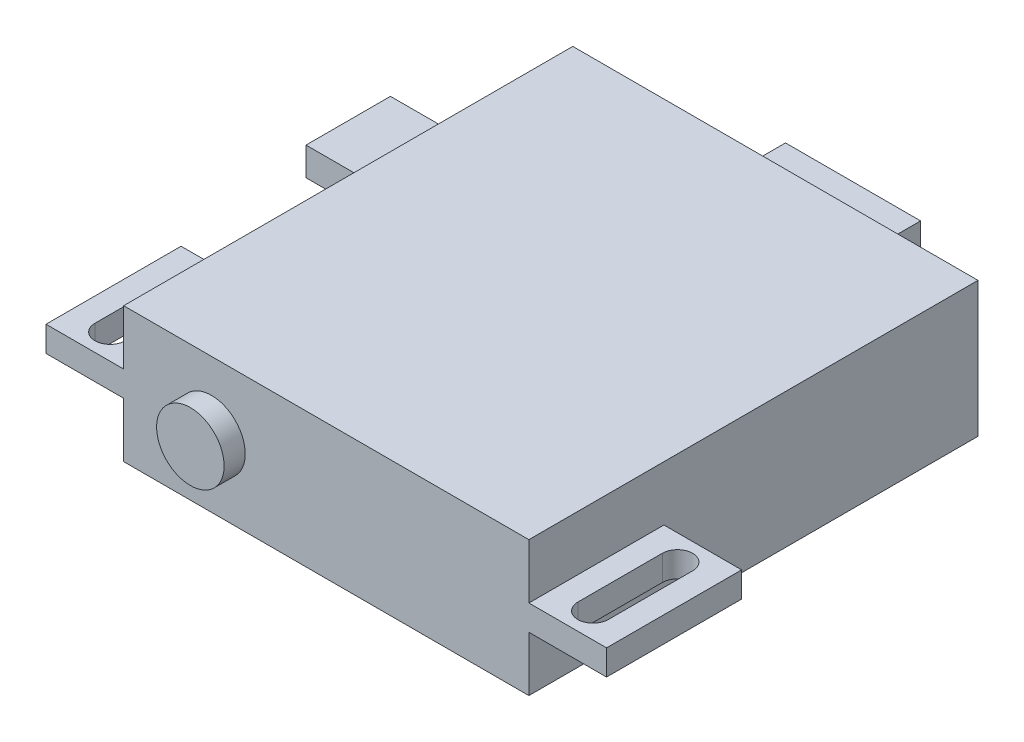
ISO-10303-21;
HEADER;
FILE_DESCRIPTION(('STEP AP214'),'2;1');
FILE_NAME('part.step','',(''),(''),'','','');
FILE_SCHEMA(('AUTOMOTIVE_DESIGN { 1 0 10303 214 1 1 1 1 }'));
ENDSEC;
DATA;
#1=APPLICATION_CONTEXT('core data for automotive mechanical design processes');
#2=APPLICATION_PROTOCOL_DEFINITION('international standard','automotive_design',2000,#1);
#3=PRODUCT_CONTEXT('',#1,'mechanical');
#4=PRODUCT('Part','Part','',(#3));
#5=PRODUCT_RELATED_PRODUCT_CATEGORY('part','',(#4));
#6=PRODUCT_DEFINITION_FORMATION('','',#4);
#7=PRODUCT_DEFINITION_CONTEXT('part definition',#1,'design');
#8=PRODUCT_DEFINITION('design','',#6,#7);
#9=PRODUCT_DEFINITION_SHAPE('','',#8);
#10=(LENGTH_UNIT() NAMED_UNIT(*) SI_UNIT(.MILLI.,.METRE.));
#11=(NAMED_UNIT(*) PLANE_ANGLE_UNIT() SI_UNIT($,.RADIAN.));
#12=(NAMED_UNIT(*) SI_UNIT($,.STERADIAN.) SOLID_ANGLE_UNIT());
#13=UNCERTAINTY_MEASURE_WITH_UNIT(LENGTH_MEASURE(1.E-05),#10,'distance_accuracy_value','');
#14=(GEOMETRIC_REPRESENTATION_CONTEXT(3) GLOBAL_UNCERTAINTY_ASSIGNED_CONTEXT((#13)) GLOBAL_UNIT_ASSIGNED_CONTEXT((#10,
#11,#12)) REPRESENTATION_CONTEXT('',''));
#15=CARTESIAN_POINT('',(0.,0.,0.));
#16=DIRECTION('',(0.,0.,1.));
#17=DIRECTION('',(1.,0.,0.));
#18=AXIS2_PLACEMENT_3D('',#15,#16,#17);
#19=CARTESIAN_POINT('',(-15.24,5.08,-16.891));
#20=DIRECTION('',(1.,0.,0.));
#21=DIRECTION('',(0.,0.,-1.));
#22=AXIS2_PLACEMENT_3D('',#19,#20,#21);
#23=PLANE('',#22);
#24=DIRECTION('',(0.,0.,1.));
#25=VECTOR('',#24,1.);
#26=CARTESIAN_POINT('',(-15.24,-0.9525,6.731));
#27=LINE('',#26,#25);
#28=CARTESIAN_POINT('',(-15.24,-0.9525,6.731));
#29=VERTEX_POINT('',#28);
#30=CARTESIAN_POINT('',(-15.24,-0.9525,16.891));
#31=VERTEX_POINT('',#30);
#32=EDGE_CURVE('E367',#29,#31,#27,.T.);
#33=ORIENTED_EDGE('',*,*,#32,.F.);
#34=DIRECTION('',(0.,-1.,0.));
#35=VECTOR('',#34,1.);
#36=CARTESIAN_POINT('',(-15.24,0.9525,6.731));
#37=LINE('',#36,#35);
#38=CARTESIAN_POINT('',(-15.24,0.9525,6.731));
#39=VERTEX_POINT('',#38);
#40=EDGE_CURVE('E394',#39,#29,#37,.T.);
#41=ORIENTED_EDGE('',*,*,#40,.F.);
#42=DIRECTION('',(0.,0.,1.));
#43=VECTOR('',#42,1.);
#44=CARTESIAN_POINT('',(-15.24,0.9525,6.731));
#45=LINE('',#44,#43);
#46=CARTESIAN_POINT('',(-15.24,0.9525,16.891));
#47=VERTEX_POINT('',#46);
#48=EDGE_CURVE('E368',#39,#47,#45,.T.);
#49=ORIENTED_EDGE('',*,*,#48,.T.);
#50=DIRECTION('',(0.,-1.,0.));
#51=VECTOR('',#50,1.);
#52=CARTESIAN_POINT('',(-15.24,5.08,16.891));
#53=LINE('',#52,#51);
#54=CARTESIAN_POINT('',(-15.24,5.08,16.891));
#55=VERTEX_POINT('',#54);
#56=EDGE_CURVE('E483',#55,#47,#53,.T.);
#57=ORIENTED_EDGE('',*,*,#56,.F.);
#58=DIRECTION('',(0.,0.,1.));
#59=VECTOR('',#58,1.);
#60=CARTESIAN_POINT('',(-15.24,5.08,-16.891));
#61=LINE('',#60,#59);
#62=CARTESIAN_POINT('',(-15.24,5.08,-16.891));
#63=VERTEX_POINT('',#62);
#64=EDGE_CURVE('E465',#63,#55,#61,.T.);
#65=ORIENTED_EDGE('',*,*,#64,.F.);
#66=DIRECTION('',(0.,-1.,0.));
#67=VECTOR('',#66,1.);
#68=CARTESIAN_POINT('',(-15.24,5.08,-16.891));
#69=LINE('',#68,#67);
#70=CARTESIAN_POINT('',(-15.24,-5.08,-16.891));
#71=VERTEX_POINT('',#70);
#72=EDGE_CURVE('E486',#63,#71,#69,.T.);
#73=ORIENTED_EDGE('',*,*,#72,.T.);
#74=DIRECTION('',(0.,0.,1.));
#75=VECTOR('',#74,1.);
#76=CARTESIAN_POINT('',(-15.24,-5.08,-16.891));
#77=LINE('',#76,#75);
#78=CARTESIAN_POINT('',(-15.24,-5.08,16.891));
#79=VERTEX_POINT('',#78);
#80=EDGE_CURVE('E474',#71,#79,#77,.T.);
#81=ORIENTED_EDGE('',*,*,#80,.T.);
#82=EDGE_CURVE('E482',#31,#79,#53,.T.);
#83=ORIENTED_EDGE('',*,*,#82,.F.);
#84=EDGE_LOOP('',(#33,#41,#49,#57,#65,#73,#81,#83));
#85=FACE_BOUND('',#84,.T.);
#86=DIRECTION('',(0.,1.,0.));
#87=VECTOR('',#86,1.);
#88=CARTESIAN_POINT('',(-15.24,1.06561722615101,-4.445));
#89=LINE('',#88,#87);
#90=CARTESIAN_POINT('',(-15.24,-1.06561722615101,-4.445));
#91=VERTEX_POINT('',#90);
#92=CARTESIAN_POINT('',(-15.24,1.06561722615101,-4.445));
#93=VERTEX_POINT('',#92);
#94=EDGE_CURVE('E267',#91,#93,#89,.T.);
#95=ORIENTED_EDGE('',*,*,#94,.F.);
#96=DIRECTION('',(0.,0.,1.));
#97=VECTOR('',#96,1.);
#98=CARTESIAN_POINT('',(-15.24,-1.06561722615101,-10.795));
#99=LINE('',#98,#97);
#100=CARTESIAN_POINT('',(-15.24,-1.06561722615101,-10.795));
#101=VERTEX_POINT('',#100);
#102=EDGE_CURVE('E264',#101,#91,#99,.T.);
#103=ORIENTED_EDGE('',*,*,#102,.F.);
#104=DIRECTION('',(0.,-1.,0.));
#105=VECTOR('',#104,1.);
#106=CARTESIAN_POINT('',(-15.24,1.06561722615101,-10.795));
#107=LINE('',#106,#105);
#108=CARTESIAN_POINT('',(-15.24,1.06561722615101,-10.795));
#109=VERTEX_POINT('',#108);
#110=EDGE_CURVE('E58',#109,#101,#107,.T.);
#111=ORIENTED_EDGE('',*,*,#110,.F.);
#112=DIRECTION('',(0.,0.,-1.));
#113=VECTOR('',#112,1.);
#114=CARTESIAN_POINT('',(-15.24,1.06561722615101,-10.795));
#115=LINE('',#114,#113);
#116=EDGE_CURVE('E53',#93,#109,#115,.T.);
#117=ORIENTED_EDGE('',*,*,#116,.F.);
#118=EDGE_LOOP('',(#95,#103,#111,#117));
#119=FACE_BOUND('',#118,.T.);
#120=ADVANCED_FACE('F38',(#85,#119),#23,.F.);
#121=CARTESIAN_POINT('',(15.24,5.08,-16.891));
#122=DIRECTION('',(-1.,0.,0.));
#123=DIRECTION('',(0.,0.,1.));
#124=AXIS2_PLACEMENT_3D('',#121,#122,#123);
#125=PLANE('',#124);
#126=DIRECTION('',(0.,-1.,0.));
#127=VECTOR('',#126,1.);
#128=CARTESIAN_POINT('',(15.24,0.9525,6.731));
#129=LINE('',#128,#127);
#130=CARTESIAN_POINT('',(15.24,0.9525,6.731));
#131=VERTEX_POINT('',#130);
#132=CARTESIAN_POINT('',(15.24,-0.9525,6.731));
#133=VERTEX_POINT('',#132);
#134=EDGE_CURVE('E438',#131,#133,#129,.T.);
#135=ORIENTED_EDGE('',*,*,#134,.T.);
#136=DIRECTION('',(0.,0.,1.));
#137=VECTOR('',#136,1.);
#138=CARTESIAN_POINT('',(15.24,-0.9525,6.731));
#139=LINE('',#138,#137);
#140=CARTESIAN_POINT('',(15.24,-0.9525,16.891));
#141=VERTEX_POINT('',#140);
#142=EDGE_CURVE('E427',#133,#141,#139,.T.);
#143=ORIENTED_EDGE('',*,*,#142,.T.);
#144=DIRECTION('',(0.,-1.,0.));
#145=VECTOR('',#144,1.);
#146=CARTESIAN_POINT('',(15.24,5.08,16.891));
#147=LINE('',#146,#145);
#148=CARTESIAN_POINT('',(15.24,-5.08,16.891));
#149=VERTEX_POINT('',#148);
#150=EDGE_CURVE('E469',#141,#149,#147,.T.);
#151=ORIENTED_EDGE('',*,*,#150,.T.);
#152=DIRECTION('',(0.,0.,-1.));
#153=VECTOR('',#152,1.);
#154=CARTESIAN_POINT('',(15.24,-5.08,-16.891));
#155=LINE('',#154,#153);
#156=CARTESIAN_POINT('',(15.24,-5.08,-16.891));
#157=VERTEX_POINT('',#156);
#158=EDGE_CURVE('E458',#149,#157,#155,.T.);
#159=ORIENTED_EDGE('',*,*,#158,.T.);
#160=DIRECTION('',(0.,-1.,0.));
#161=VECTOR('',#160,1.);
#162=CARTESIAN_POINT('',(15.24,5.08,-16.891));
#163=LINE('',#162,#161);
#164=CARTESIAN_POINT('',(15.24,5.08,-16.891));
#165=VERTEX_POINT('',#164);
#166=EDGE_CURVE('E46',#165,#157,#163,.T.);
#167=ORIENTED_EDGE('',*,*,#166,.F.);
#168=DIRECTION('',(0.,0.,-1.));
#169=VECTOR('',#168,1.);
#170=CARTESIAN_POINT('',(15.24,5.08,-16.891));
#171=LINE('',#170,#169);
#172=CARTESIAN_POINT('',(15.24,5.08,16.891));
#173=VERTEX_POINT('',#172);
#174=EDGE_CURVE('E459',#173,#165,#171,.T.);
#175=ORIENTED_EDGE('',*,*,#174,.F.);
#176=CARTESIAN_POINT('',(15.24,0.9525,16.891));
#177=VERTEX_POINT('',#176);
#178=EDGE_CURVE('E479',#173,#177,#147,.T.);
#179=ORIENTED_EDGE('',*,*,#178,.T.);
#180=DIRECTION('',(0.,0.,1.));
#181=VECTOR('',#180,1.);
#182=CARTESIAN_POINT('',(15.24,0.9525,6.731));
#183=LINE('',#182,#181);
#184=EDGE_CURVE('E428',#131,#177,#183,.T.);
#185=ORIENTED_EDGE('',*,*,#184,.F.);
#186=EDGE_LOOP('',(#135,#143,#151,#159,#167,#175,#179,#185));
#187=FACE_BOUND('',#186,.T.);
#188=ADVANCED_FACE('F40',(#187),#125,.F.);
#189=CARTESIAN_POINT('',(-15.24,5.08,-16.891));
#190=DIRECTION('',(0.,0.,1.));
#191=DIRECTION('',(1.,0.,0.));
#192=AXIS2_PLACEMENT_3D('',#189,#190,#191);
#193=PLANE('',#192);
#194=DIRECTION('',(0.,-1.,0.));
#195=VECTOR('',#194,1.);
#196=CARTESIAN_POINT('',(-5.08,0.9525,-16.891));
#197=LINE('',#196,#195);
#198=CARTESIAN_POINT('',(-5.08,0.9525,-16.891));
#199=VERTEX_POINT('',#198);
#200=CARTESIAN_POINT('',(-5.08,-0.9525,-16.891));
#201=VERTEX_POINT('',#200);
#202=EDGE_CURVE('E326',#199,#201,#197,.T.);
#203=ORIENTED_EDGE('',*,*,#202,.T.);
#204=DIRECTION('',(1.,0.,0.));
#205=VECTOR('',#204,1.);
#206=CARTESIAN_POINT('',(-5.08,-0.9525,-16.891));
#207=LINE('',#206,#205);
#208=CARTESIAN_POINT('',(5.08,-0.9525,-16.891));
#209=VERTEX_POINT('',#208);
#210=EDGE_CURVE('E309',#201,#209,#207,.T.);
#211=ORIENTED_EDGE('',*,*,#210,.T.);
#212=DIRECTION('',(0.,-1.,0.));
#213=VECTOR('',#212,1.);
#214=CARTESIAN_POINT('',(5.08,0.9525,-16.891));
#215=LINE('',#214,#213);
#216=CARTESIAN_POINT('',(5.08,0.9525,-16.891));
#217=VERTEX_POINT('',#216);
#218=EDGE_CURVE('E315',#217,#209,#215,.T.);
#219=ORIENTED_EDGE('',*,*,#218,.F.);
#220=DIRECTION('',(1.,0.,0.));
#221=VECTOR('',#220,1.);
#222=CARTESIAN_POINT('',(-5.08,0.9525,-16.891));
#223=LINE('',#222,#221);
#224=EDGE_CURVE('E313',#199,#217,#223,.T.);
#225=ORIENTED_EDGE('',*,*,#224,.F.);
#226=EDGE_LOOP('',(#203,#211,#219,#225));
#227=FACE_BOUND('',#226,.T.);
#228=DIRECTION('',(-1.,0.,0.));
#229=VECTOR('',#228,1.);
#230=CARTESIAN_POINT('',(-15.24,-5.08,-16.891));
#231=LINE('',#230,#229);
#232=EDGE_CURVE('E472',#157,#71,#231,.T.);
#233=ORIENTED_EDGE('',*,*,#232,.T.);
#234=ORIENTED_EDGE('',*,*,#72,.F.);
#235=DIRECTION('',(-1.,0.,0.));
#236=VECTOR('',#235,1.);
#237=CARTESIAN_POINT('',(-15.24,5.08,-16.891));
#238=LINE('',#237,#236);
#239=EDGE_CURVE('E462',#165,#63,#238,.T.);
#240=ORIENTED_EDGE('',*,*,#239,.F.);
#241=ORIENTED_EDGE('',*,*,#166,.T.);
#242=EDGE_LOOP('',(#233,#234,#240,#241));
#243=FACE_BOUND('',#242,.T.);
#244=ADVANCED_FACE('F491',(#227,#243),#193,.F.);
#245=CARTESIAN_POINT('',(-15.24,5.08,16.891));
#246=DIRECTION('',(0.,0.,-1.));
#247=DIRECTION('',(-1.,0.,0.));
#248=AXIS2_PLACEMENT_3D('',#245,#246,#247);
#249=PLANE('',#248);
#250=CARTESIAN_POINT('',(-8.636,0.,16.891));
#251=DIRECTION('',(0.,0.,-1.));
#252=DIRECTION('',(-1.,0.,0.));
#253=AXIS2_PLACEMENT_3D('',#250,#251,#252);
#254=CIRCLE('',#253,2.54);
#255=CARTESIAN_POINT('',(-11.176,0.,16.891));
#256=VERTEX_POINT('',#255);
#257=EDGE_CURVE('E11',#256,#256,#254,.F.);
#258=ORIENTED_EDGE('',*,*,#257,.F.);
#259=EDGE_LOOP('',(#258));
#260=FACE_BOUND('',#259,.T.);
#261=DIRECTION('',(1.,0.,0.));
#262=VECTOR('',#261,1.);
#263=CARTESIAN_POINT('',(-15.24,-5.08,16.891));
#264=LINE('',#263,#262);
#265=EDGE_CURVE('E463',#79,#149,#264,.T.);
#266=ORIENTED_EDGE('',*,*,#265,.T.);
#267=ORIENTED_EDGE('',*,*,#150,.F.);
#268=DIRECTION('',(1.,0.,0.));
#269=VECTOR('',#268,1.);
#270=CARTESIAN_POINT('',(15.24,-0.9525,16.891));
#271=LINE('',#270,#269);
#272=CARTESIAN_POINT('',(21.082,-0.9525,16.891));
#273=VERTEX_POINT('',#272);
#274=EDGE_CURVE('E441',#141,#273,#271,.T.);
#275=ORIENTED_EDGE('',*,*,#274,.T.);
#276=DIRECTION('',(0.,-1.,0.));
#277=VECTOR('',#276,1.);
#278=CARTESIAN_POINT('',(21.082,0.9525,16.891));
#279=LINE('',#278,#277);
#280=CARTESIAN_POINT('',(21.082,0.9525,16.891));
#281=VERTEX_POINT('',#280);
#282=EDGE_CURVE('E452',#281,#273,#279,.T.);
#283=ORIENTED_EDGE('',*,*,#282,.F.);
#284=DIRECTION('',(1.,0.,0.));
#285=VECTOR('',#284,1.);
#286=CARTESIAN_POINT('',(15.24,0.9525,16.891));
#287=LINE('',#286,#285);
#288=EDGE_CURVE('E431',#177,#281,#287,.T.);
#289=ORIENTED_EDGE('',*,*,#288,.F.);
#290=ORIENTED_EDGE('',*,*,#178,.F.);
#291=DIRECTION('',(1.,0.,0.));
#292=VECTOR('',#291,1.);
#293=CARTESIAN_POINT('',(-15.24,5.08,16.891));
#294=LINE('',#293,#292);
#295=EDGE_CURVE('E467',#55,#173,#294,.T.);
#296=ORIENTED_EDGE('',*,*,#295,.F.);
#297=ORIENTED_EDGE('',*,*,#56,.T.);
#298=DIRECTION('',(-1.,0.,0.));
#299=VECTOR('',#298,1.);
#300=CARTESIAN_POINT('',(-15.24,0.9525,16.891));
#301=LINE('',#300,#299);
#302=CARTESIAN_POINT('',(-21.082,0.9525,16.891));
#303=VERTEX_POINT('',#302);
#304=EDGE_CURVE('E378',#47,#303,#301,.T.);
#305=ORIENTED_EDGE('',*,*,#304,.T.);
#306=DIRECTION('',(0.,-1.,0.));
#307=VECTOR('',#306,1.);
#308=CARTESIAN_POINT('',(-21.082,0.9525,16.891));
#309=LINE('',#308,#307);
#310=CARTESIAN_POINT('',(-21.082,-0.9525,16.891));
#311=VERTEX_POINT('',#310);
#312=EDGE_CURVE('E381',#303,#311,#309,.T.);
#313=ORIENTED_EDGE('',*,*,#312,.T.);
#314=DIRECTION('',(-1.,0.,0.));
#315=VECTOR('',#314,1.);
#316=CARTESIAN_POINT('',(-15.24,-0.9525,16.891));
#317=LINE('',#316,#315);
#318=EDGE_CURVE('E372',#31,#311,#317,.T.);
#319=ORIENTED_EDGE('',*,*,#318,.F.);
#320=ORIENTED_EDGE('',*,*,#82,.T.);
#321=EDGE_LOOP('',(#266,#267,#275,#283,#289,#290,#296,#297,#305,#313,#319,#320));
#322=FACE_BOUND('',#321,.T.);
#323=ADVANCED_FACE('F512',(#260,#322),#249,.F.);
#324=CARTESIAN_POINT('',(0.,5.08,0.));
#325=DIRECTION('',(0.,1.,0.));
#326=DIRECTION('',(0.,0.,1.));
#327=AXIS2_PLACEMENT_3D('',#324,#325,#326);
#328=PLANE('',#327);
#329=ORIENTED_EDGE('',*,*,#174,.T.);
#330=ORIENTED_EDGE('',*,*,#239,.T.);
#331=ORIENTED_EDGE('',*,*,#64,.T.);
#332=ORIENTED_EDGE('',*,*,#295,.T.);
#333=EDGE_LOOP('',(#329,#330,#331,#332));
#334=FACE_BOUND('',#333,.T.);
#335=ADVANCED_FACE('F508',(#334),#328,.T.);
#336=CARTESIAN_POINT('',(0.,-5.08,0.));
#337=DIRECTION('',(0.,1.,0.));
#338=DIRECTION('',(0.,0.,1.));
#339=AXIS2_PLACEMENT_3D('',#336,#337,#338);
#340=PLANE('',#339);
#341=ORIENTED_EDGE('',*,*,#158,.F.);
#342=ORIENTED_EDGE('',*,*,#265,.F.);
#343=ORIENTED_EDGE('',*,*,#80,.F.);
#344=ORIENTED_EDGE('',*,*,#232,.F.);
#345=EDGE_LOOP('',(#341,#342,#343,#344));
#346=FACE_BOUND('',#345,.T.);
#347=ADVANCED_FACE('F499',(#346),#340,.F.);
#348=CARTESIAN_POINT('',(-8.636,0.,18.4785));
#349=DIRECTION('',(0.,0.,-1.));
#350=DIRECTION('',(-1.,0.,0.));
#351=AXIS2_PLACEMENT_3D('',#348,#349,#350);
#352=CYLINDRICAL_SURFACE('',#351,2.54);
#353=CARTESIAN_POINT('',(-8.636,0.,18.4785));
#354=DIRECTION('',(0.,0.,1.));
#355=DIRECTION('',(1.,0.,0.));
#356=AXIS2_PLACEMENT_3D('',#353,#354,#355);
#357=CIRCLE('',#356,2.54);
#358=CARTESIAN_POINT('',(-6.096,0.,18.4785));
#359=VERTEX_POINT('',#358);
#360=EDGE_CURVE('E455',#359,#359,#357,.T.);
#361=ORIENTED_EDGE('',*,*,#360,.F.);
#362=EDGE_LOOP('',(#361));
#363=FACE_BOUND('',#362,.T.);
#364=ORIENTED_EDGE('',*,*,#257,.T.);
#365=EDGE_LOOP('',(#364));
#366=FACE_BOUND('',#365,.T.);
#367=ADVANCED_FACE('F894',(#363,#366),#352,.T.);
#368=CARTESIAN_POINT('',(-8.636,0.,18.4785));
#369=DIRECTION('',(0.,0.,1.));
#370=DIRECTION('',(1.,0.,0.));
#371=AXIS2_PLACEMENT_3D('',#368,#369,#370);
#372=PLANE('',#371);
#373=ORIENTED_EDGE('',*,*,#360,.T.);
#374=EDGE_LOOP('',(#373));
#375=FACE_BOUND('',#374,.T.);
#376=ADVANCED_FACE('F879',(#375),#372,.T.);
#377=CARTESIAN_POINT('',(0.,0.9525,0.));
#378=DIRECTION('',(0.,1.,0.));
#379=DIRECTION('',(0.,0.,1.));
#380=AXIS2_PLACEMENT_3D('',#377,#378,#379);
#381=PLANE('',#380);
#382=ORIENTED_EDGE('',*,*,#184,.T.);
#383=ORIENTED_EDGE('',*,*,#288,.T.);
#384=DIRECTION('',(0.,0.,-1.));
#385=VECTOR('',#384,1.);
#386=CARTESIAN_POINT('',(21.082,0.9525,6.731));
#387=LINE('',#386,#385);
#388=CARTESIAN_POINT('',(21.082,0.9525,6.731));
#389=VERTEX_POINT('',#388);
#390=EDGE_CURVE('E434',#281,#389,#387,.T.);
#391=ORIENTED_EDGE('',*,*,#390,.T.);
#392=DIRECTION('',(-1.,0.,0.));
#393=VECTOR('',#392,1.);
#394=CARTESIAN_POINT('',(15.24,0.9525,6.731));
#395=LINE('',#394,#393);
#396=EDGE_CURVE('E436',#389,#131,#395,.T.);
#397=ORIENTED_EDGE('',*,*,#396,.T.);
#398=EDGE_LOOP('',(#382,#383,#391,#397));
#399=FACE_BOUND('',#398,.T.);
#400=DIRECTION('',(0.,0.,1.));
#401=VECTOR('',#400,1.);
#402=CARTESIAN_POINT('',(17.018,0.9525,8.636));
#403=LINE('',#402,#401);
#404=CARTESIAN_POINT('',(17.018,0.9525,8.636));
#405=VERTEX_POINT('',#404);
#406=CARTESIAN_POINT('',(17.018,0.9525,14.986));
#407=VERTEX_POINT('',#406);
#408=EDGE_CURVE('E399',#405,#407,#403,.T.);
#409=ORIENTED_EDGE('',*,*,#408,.F.);
#410=CARTESIAN_POINT('',(18.161,0.9525,8.636));
#411=DIRECTION('',(0.,1.,0.));
#412=DIRECTION('',(0.,0.,1.));
#413=AXIS2_PLACEMENT_3D('',#410,#411,#412);
#414=CIRCLE('',#413,1.143);
#415=CARTESIAN_POINT('',(19.304,0.9525,8.636));
#416=VERTEX_POINT('',#415);
#417=EDGE_CURVE('E397',#416,#405,#414,.T.);
#418=ORIENTED_EDGE('',*,*,#417,.F.);
#419=DIRECTION('',(0.,0.,-1.));
#420=VECTOR('',#419,1.);
#421=CARTESIAN_POINT('',(19.304,0.9525,8.636));
#422=LINE('',#421,#420);
#423=CARTESIAN_POINT('',(19.304,0.9525,14.986));
#424=VERTEX_POINT('',#423);
#425=EDGE_CURVE('E405',#424,#416,#422,.T.);
#426=ORIENTED_EDGE('',*,*,#425,.F.);
#427=CARTESIAN_POINT('',(18.161,0.9525,14.986));
#428=DIRECTION('',(0.,1.,0.));
#429=DIRECTION('',(0.,0.,1.));
#430=AXIS2_PLACEMENT_3D('',#427,#428,#429);
#431=CIRCLE('',#430,1.143);
#432=EDGE_CURVE('E402',#407,#424,#431,.T.);
#433=ORIENTED_EDGE('',*,*,#432,.F.);
#434=EDGE_LOOP('',(#409,#418,#426,#433));
#435=FACE_BOUND('',#434,.T.);
#436=ADVANCED_FACE('F516',(#399,#435),#381,.T.);
#437=CARTESIAN_POINT('',(0.,-0.9525,0.));
#438=DIRECTION('',(0.,1.,0.));
#439=DIRECTION('',(0.,0.,1.));
#440=AXIS2_PLACEMENT_3D('',#437,#438,#439);
#441=PLANE('',#440);
#442=ORIENTED_EDGE('',*,*,#142,.F.);
#443=DIRECTION('',(-1.,0.,0.));
#444=VECTOR('',#443,1.);
#445=CARTESIAN_POINT('',(15.24,-0.9525,6.731));
#446=LINE('',#445,#444);
#447=CARTESIAN_POINT('',(21.082,-0.9525,6.731));
#448=VERTEX_POINT('',#447);
#449=EDGE_CURVE('E432',#448,#133,#446,.T.);
#450=ORIENTED_EDGE('',*,*,#449,.F.);
#451=DIRECTION('',(0.,0.,-1.));
#452=VECTOR('',#451,1.);
#453=CARTESIAN_POINT('',(21.082,-0.9525,6.731));
#454=LINE('',#453,#452);
#455=EDGE_CURVE('E443',#273,#448,#454,.T.);
#456=ORIENTED_EDGE('',*,*,#455,.F.);
#457=ORIENTED_EDGE('',*,*,#274,.F.);
#458=EDGE_LOOP('',(#442,#450,#456,#457));
#459=FACE_BOUND('',#458,.T.);
#460=CARTESIAN_POINT('',(18.161,-0.9525,8.636));
#461=DIRECTION('',(0.,1.,0.));
#462=DIRECTION('',(0.,0.,1.));
#463=AXIS2_PLACEMENT_3D('',#460,#461,#462);
#464=CIRCLE('',#463,1.143);
#465=CARTESIAN_POINT('',(19.304,-0.9525,8.636));
#466=VERTEX_POINT('',#465);
#467=CARTESIAN_POINT('',(17.018,-0.9525,8.636));
#468=VERTEX_POINT('',#467);
#469=EDGE_CURVE('E396',#466,#468,#464,.T.);
#470=ORIENTED_EDGE('',*,*,#469,.T.);
#471=DIRECTION('',(0.,0.,1.));
#472=VECTOR('',#471,1.);
#473=CARTESIAN_POINT('',(17.018,-0.9525,8.636));
#474=LINE('',#473,#472);
#475=CARTESIAN_POINT('',(17.018,-0.9525,14.986));
#476=VERTEX_POINT('',#475);
#477=EDGE_CURVE('E410',#468,#476,#474,.T.);
#478=ORIENTED_EDGE('',*,*,#477,.T.);
#479=CARTESIAN_POINT('',(18.161,-0.9525,14.986));
#480=DIRECTION('',(0.,1.,0.));
#481=DIRECTION('',(0.,0.,1.));
#482=AXIS2_PLACEMENT_3D('',#479,#480,#481);
#483=CIRCLE('',#482,1.143);
#484=CARTESIAN_POINT('',(19.304,-0.9525,14.986));
#485=VERTEX_POINT('',#484);
#486=EDGE_CURVE('E413',#476,#485,#483,.T.);
#487=ORIENTED_EDGE('',*,*,#486,.T.);
#488=DIRECTION('',(0.,0.,-1.));
#489=VECTOR('',#488,1.);
#490=CARTESIAN_POINT('',(19.304,-0.9525,8.636));
#491=LINE('',#490,#489);
#492=EDGE_CURVE('E400',#485,#466,#491,.T.);
#493=ORIENTED_EDGE('',*,*,#492,.T.);
#494=EDGE_LOOP('',(#470,#478,#487,#493));
#495=FACE_BOUND('',#494,.T.);
#496=ADVANCED_FACE('F865',(#459,#495),#441,.F.);
#497=CARTESIAN_POINT('',(21.082,0.9525,6.731));
#498=DIRECTION('',(-1.,0.,0.));
#499=DIRECTION('',(0.,0.,1.));
#500=AXIS2_PLACEMENT_3D('',#497,#498,#499);
#501=PLANE('',#500);
#502=ORIENTED_EDGE('',*,*,#455,.T.);
#503=DIRECTION('',(0.,-1.,0.));
#504=VECTOR('',#503,1.);
#505=CARTESIAN_POINT('',(21.082,0.9525,6.731));
#506=LINE('',#505,#504);
#507=EDGE_CURVE('E449',#389,#448,#506,.T.);
#508=ORIENTED_EDGE('',*,*,#507,.F.);
#509=ORIENTED_EDGE('',*,*,#390,.F.);
#510=ORIENTED_EDGE('',*,*,#282,.T.);
#511=EDGE_LOOP('',(#502,#508,#509,#510));
#512=FACE_BOUND('',#511,.T.);
#513=ADVANCED_FACE('F857',(#512),#501,.F.);
#514=CARTESIAN_POINT('',(15.24,0.9525,6.731));
#515=DIRECTION('',(0.,0.,1.));
#516=DIRECTION('',(1.,0.,0.));
#517=AXIS2_PLACEMENT_3D('',#514,#515,#516);
#518=PLANE('',#517);
#519=ORIENTED_EDGE('',*,*,#449,.T.);
#520=ORIENTED_EDGE('',*,*,#134,.F.);
#521=ORIENTED_EDGE('',*,*,#396,.F.);
#522=ORIENTED_EDGE('',*,*,#507,.T.);
#523=EDGE_LOOP('',(#519,#520,#521,#522));
#524=FACE_BOUND('',#523,.T.);
#525=ADVANCED_FACE('F522',(#524),#518,.F.);
#526=CARTESIAN_POINT('',(18.161,0.9525,8.636));
#527=DIRECTION('',(0.,-1.,0.));
#528=DIRECTION('',(0.,0.,-1.));
#529=AXIS2_PLACEMENT_3D('',#526,#527,#528);
#530=CYLINDRICAL_SURFACE('',#529,1.143);
#531=ORIENTED_EDGE('',*,*,#469,.F.);
#532=DIRECTION('',(0.,-1.,0.));
#533=VECTOR('',#532,1.);
#534=CARTESIAN_POINT('',(19.304,0.9525,8.636));
#535=LINE('',#534,#533);
#536=EDGE_CURVE('E407',#416,#466,#535,.T.);
#537=ORIENTED_EDGE('',*,*,#536,.F.);
#538=ORIENTED_EDGE('',*,*,#417,.T.);
#539=DIRECTION('',(0.,-1.,0.));
#540=VECTOR('',#539,1.);
#541=CARTESIAN_POINT('',(17.018,0.9525,8.636));
#542=LINE('',#541,#540);
#543=EDGE_CURVE('E424',#405,#468,#542,.T.);
#544=ORIENTED_EDGE('',*,*,#543,.T.);
#545=EDGE_LOOP('',(#531,#537,#538,#544));
#546=FACE_BOUND('',#545,.T.);
#547=ADVANCED_FACE('F840',(#546),#530,.F.);
#548=CARTESIAN_POINT('',(17.018,0.9525,8.636));
#549=DIRECTION('',(1.,0.,0.));
#550=DIRECTION('',(0.,0.,-1.));
#551=AXIS2_PLACEMENT_3D('',#548,#549,#550);
#552=PLANE('',#551);
#553=ORIENTED_EDGE('',*,*,#477,.F.);
#554=ORIENTED_EDGE('',*,*,#543,.F.);
#555=ORIENTED_EDGE('',*,*,#408,.T.);
#556=DIRECTION('',(0.,-1.,0.));
#557=VECTOR('',#556,1.);
#558=CARTESIAN_POINT('',(17.018,0.9525,14.986));
#559=LINE('',#558,#557);
#560=EDGE_CURVE('E422',#407,#476,#559,.T.);
#561=ORIENTED_EDGE('',*,*,#560,.T.);
#562=EDGE_LOOP('',(#553,#554,#555,#561));
#563=FACE_BOUND('',#562,.T.);
#564=ADVANCED_FACE('F831',(#563),#552,.T.);
#565=CARTESIAN_POINT('',(18.161,0.9525,14.986));
#566=DIRECTION('',(0.,-1.,0.));
#567=DIRECTION('',(0.,0.,-1.));
#568=AXIS2_PLACEMENT_3D('',#565,#566,#567);
#569=CYLINDRICAL_SURFACE('',#568,1.143);
#570=ORIENTED_EDGE('',*,*,#486,.F.);
#571=ORIENTED_EDGE('',*,*,#560,.F.);
#572=ORIENTED_EDGE('',*,*,#432,.T.);
#573=DIRECTION('',(0.,-1.,0.));
#574=VECTOR('',#573,1.);
#575=CARTESIAN_POINT('',(19.304,0.9525,14.986));
#576=LINE('',#575,#574);
#577=EDGE_CURVE('E420',#424,#485,#576,.T.);
#578=ORIENTED_EDGE('',*,*,#577,.T.);
#579=EDGE_LOOP('',(#570,#571,#572,#578));
#580=FACE_BOUND('',#579,.T.);
#581=ADVANCED_FACE('F822',(#580),#569,.F.);
#582=CARTESIAN_POINT('',(19.304,0.9525,8.636));
#583=DIRECTION('',(-1.,0.,0.));
#584=DIRECTION('',(0.,0.,1.));
#585=AXIS2_PLACEMENT_3D('',#582,#583,#584);
#586=PLANE('',#585);
#587=ORIENTED_EDGE('',*,*,#492,.F.);
#588=ORIENTED_EDGE('',*,*,#577,.F.);
#589=ORIENTED_EDGE('',*,*,#425,.T.);
#590=ORIENTED_EDGE('',*,*,#536,.T.);
#591=EDGE_LOOP('',(#587,#588,#589,#590));
#592=FACE_BOUND('',#591,.T.);
#593=ADVANCED_FACE('F547',(#592),#586,.T.);
#594=CARTESIAN_POINT('',(-15.24,0.9525,6.731));
#595=DIRECTION('',(0.,0.,-1.));
#596=DIRECTION('',(-1.,0.,0.));
#597=AXIS2_PLACEMENT_3D('',#594,#595,#596);
#598=PLANE('',#597);
#599=DIRECTION('',(1.,0.,0.));
#600=VECTOR('',#599,1.);
#601=CARTESIAN_POINT('',(-15.24,-0.9525,6.731));
#602=LINE('',#601,#600);
#603=CARTESIAN_POINT('',(-21.082,-0.9525,6.731));
#604=VERTEX_POINT('',#603);
#605=EDGE_CURVE('E383',#604,#29,#602,.T.);
#606=ORIENTED_EDGE('',*,*,#605,.F.);
#607=DIRECTION('',(0.,-1.,0.));
#608=VECTOR('',#607,1.);
#609=CARTESIAN_POINT('',(-21.082,0.9525,6.731));
#610=LINE('',#609,#608);
#611=CARTESIAN_POINT('',(-21.082,0.9525,6.731));
#612=VERTEX_POINT('',#611);
#613=EDGE_CURVE('E392',#612,#604,#610,.T.);
#614=ORIENTED_EDGE('',*,*,#613,.F.);
#615=DIRECTION('',(1.,0.,0.));
#616=VECTOR('',#615,1.);
#617=CARTESIAN_POINT('',(-15.24,0.9525,6.731));
#618=LINE('',#617,#616);
#619=EDGE_CURVE('E371',#612,#39,#618,.T.);
#620=ORIENTED_EDGE('',*,*,#619,.T.);
#621=ORIENTED_EDGE('',*,*,#40,.T.);
#622=EDGE_LOOP('',(#606,#614,#620,#621));
#623=FACE_BOUND('',#622,.T.);
#624=ADVANCED_FACE('F532',(#623),#598,.T.);
#625=CARTESIAN_POINT('',(-21.082,0.9525,6.731));
#626=DIRECTION('',(-1.,0.,0.));
#627=DIRECTION('',(0.,0.,1.));
#628=AXIS2_PLACEMENT_3D('',#625,#626,#627);
#629=PLANE('',#628);
#630=DIRECTION('',(0.,0.,-1.));
#631=VECTOR('',#630,1.);
#632=CARTESIAN_POINT('',(-21.082,-0.9525,6.731));
#633=LINE('',#632,#631);
#634=EDGE_CURVE('E386',#311,#604,#633,.T.);
#635=ORIENTED_EDGE('',*,*,#634,.F.);
#636=ORIENTED_EDGE('',*,*,#312,.F.);
#637=DIRECTION('',(0.,0.,-1.));
#638=VECTOR('',#637,1.);
#639=CARTESIAN_POINT('',(-21.082,0.9525,6.731));
#640=LINE('',#639,#638);
#641=EDGE_CURVE('E375',#303,#612,#640,.T.);
#642=ORIENTED_EDGE('',*,*,#641,.T.);
#643=ORIENTED_EDGE('',*,*,#613,.T.);
#644=EDGE_LOOP('',(#635,#636,#642,#643));
#645=FACE_BOUND('',#644,.T.);
#646=ADVANCED_FACE('F538',(#645),#629,.T.);
#647=CARTESIAN_POINT('',(0.,0.9525,0.));
#648=DIRECTION('',(0.,1.,0.));
#649=DIRECTION('',(0.,0.,1.));
#650=AXIS2_PLACEMENT_3D('',#647,#648,#649);
#651=PLANE('',#650);
#652=CARTESIAN_POINT('',(-18.161,0.9525,8.636));
#653=DIRECTION('',(0.,-1.,0.));
#654=DIRECTION('',(0.,0.,1.));
#655=AXIS2_PLACEMENT_3D('',#652,#653,#654);
#656=CIRCLE('',#655,1.143);
#657=CARTESIAN_POINT('',(-19.304,0.9525,8.636));
#658=VERTEX_POINT('',#657);
#659=CARTESIAN_POINT('',(-17.018,0.9525,8.636));
#660=VERTEX_POINT('',#659);
#661=EDGE_CURVE('E336',#658,#660,#656,.T.);
#662=ORIENTED_EDGE('',*,*,#661,.T.);
#663=DIRECTION('',(0.,0.,1.));
#664=VECTOR('',#663,1.);
#665=CARTESIAN_POINT('',(-17.018,0.9525,8.636));
#666=LINE('',#665,#664);
#667=CARTESIAN_POINT('',(-17.018,0.9525,14.986));
#668=VERTEX_POINT('',#667);
#669=EDGE_CURVE('E346',#660,#668,#666,.T.);
#670=ORIENTED_EDGE('',*,*,#669,.T.);
#671=CARTESIAN_POINT('',(-18.161,0.9525,14.986));
#672=DIRECTION('',(0.,-1.,0.));
#673=DIRECTION('',(0.,0.,1.));
#674=AXIS2_PLACEMENT_3D('',#671,#672,#673);
#675=CIRCLE('',#674,1.143);
#676=CARTESIAN_POINT('',(-19.304,0.9525,14.986));
#677=VERTEX_POINT('',#676);
#678=EDGE_CURVE('E343',#668,#677,#675,.T.);
#679=ORIENTED_EDGE('',*,*,#678,.T.);
#680=DIRECTION('',(0.,0.,-1.));
#681=VECTOR('',#680,1.);
#682=CARTESIAN_POINT('',(-19.304,0.9525,8.636));
#683=LINE('',#682,#681);
#684=EDGE_CURVE('E339',#677,#658,#683,.T.);
#685=ORIENTED_EDGE('',*,*,#684,.T.);
#686=EDGE_LOOP('',(#662,#670,#679,#685));
#687=FACE_BOUND('',#686,.T.);
#688=ORIENTED_EDGE('',*,*,#48,.F.);
#689=ORIENTED_EDGE('',*,*,#619,.F.);
#690=ORIENTED_EDGE('',*,*,#641,.F.);
#691=ORIENTED_EDGE('',*,*,#304,.F.);
#692=EDGE_LOOP('',(#688,#689,#690,#691));
#693=FACE_BOUND('',#692,.T.);
#694=ADVANCED_FACE('F536',(#687,#693),#651,.T.);
#695=CARTESIAN_POINT('',(0.,-0.9525,0.));
#696=DIRECTION('',(0.,1.,0.));
#697=DIRECTION('',(0.,0.,1.));
#698=AXIS2_PLACEMENT_3D('',#695,#696,#697);
#699=PLANE('',#698);
#700=DIRECTION('',(0.,0.,1.));
#701=VECTOR('',#700,1.);
#702=CARTESIAN_POINT('',(-17.018,-0.9525,8.636));
#703=LINE('',#702,#701);
#704=CARTESIAN_POINT('',(-17.018,-0.9525,8.636));
#705=VERTEX_POINT('',#704);
#706=CARTESIAN_POINT('',(-17.018,-0.9525,14.986));
#707=VERTEX_POINT('',#706);
#708=EDGE_CURVE('E340',#705,#707,#703,.T.);
#709=ORIENTED_EDGE('',*,*,#708,.F.);
#710=CARTESIAN_POINT('',(-18.161,-0.9525,8.636));
#711=DIRECTION('',(0.,-1.,0.));
#712=DIRECTION('',(0.,0.,1.));
#713=AXIS2_PLACEMENT_3D('',#710,#711,#712);
#714=CIRCLE('',#713,1.143);
#715=CARTESIAN_POINT('',(-19.304,-0.9525,8.636));
#716=VERTEX_POINT('',#715);
#717=EDGE_CURVE('E335',#716,#705,#714,.T.);
#718=ORIENTED_EDGE('',*,*,#717,.F.);
#719=DIRECTION('',(0.,0.,-1.));
#720=VECTOR('',#719,1.);
#721=CARTESIAN_POINT('',(-19.304,-0.9525,8.636));
#722=LINE('',#721,#720);
#723=CARTESIAN_POINT('',(-19.304,-0.9525,14.986));
#724=VERTEX_POINT('',#723);
#725=EDGE_CURVE('E351',#724,#716,#722,.T.);
#726=ORIENTED_EDGE('',*,*,#725,.F.);
#727=CARTESIAN_POINT('',(-18.161,-0.9525,14.986));
#728=DIRECTION('',(0.,-1.,0.));
#729=DIRECTION('',(0.,0.,1.));
#730=AXIS2_PLACEMENT_3D('',#727,#728,#729);
#731=CIRCLE('',#730,1.143);
#732=EDGE_CURVE('E354',#707,#724,#731,.T.);
#733=ORIENTED_EDGE('',*,*,#732,.F.);
#734=EDGE_LOOP('',(#709,#718,#726,#733));
#735=FACE_BOUND('',#734,.T.);
#736=ORIENTED_EDGE('',*,*,#32,.T.);
#737=ORIENTED_EDGE('',*,*,#318,.T.);
#738=ORIENTED_EDGE('',*,*,#634,.T.);
#739=ORIENTED_EDGE('',*,*,#605,.T.);
#740=EDGE_LOOP('',(#736,#737,#738,#739));
#741=FACE_BOUND('',#740,.T.);
#742=ADVANCED_FACE('F528',(#735,#741),#699,.F.);
#743=CARTESIAN_POINT('',(-18.161,0.9525,8.636));
#744=DIRECTION('',(0.,-1.,0.));
#745=DIRECTION('',(0.,0.,-1.));
#746=AXIS2_PLACEMENT_3D('',#743,#744,#745);
#747=CYLINDRICAL_SURFACE('',#746,1.143);
#748=ORIENTED_EDGE('',*,*,#717,.T.);
#749=DIRECTION('',(0.,-1.,0.));
#750=VECTOR('',#749,1.);
#751=CARTESIAN_POINT('',(-17.018,0.9525,8.636));
#752=LINE('',#751,#750);
#753=EDGE_CURVE('E349',#660,#705,#752,.T.);
#754=ORIENTED_EDGE('',*,*,#753,.F.);
#755=ORIENTED_EDGE('',*,*,#661,.F.);
#756=DIRECTION('',(0.,-1.,0.));
#757=VECTOR('',#756,1.);
#758=CARTESIAN_POINT('',(-19.304,0.9525,8.636));
#759=LINE('',#758,#757);
#760=EDGE_CURVE('E365',#658,#716,#759,.T.);
#761=ORIENTED_EDGE('',*,*,#760,.T.);
#762=EDGE_LOOP('',(#748,#754,#755,#761));
#763=FACE_BOUND('',#762,.T.);
#764=ADVANCED_FACE('F606',(#763),#747,.F.);
#765=CARTESIAN_POINT('',(-19.304,0.9525,8.636));
#766=DIRECTION('',(-1.,0.,0.));
#767=DIRECTION('',(0.,0.,1.));
#768=AXIS2_PLACEMENT_3D('',#765,#766,#767);
#769=PLANE('',#768);
#770=ORIENTED_EDGE('',*,*,#725,.T.);
#771=ORIENTED_EDGE('',*,*,#760,.F.);
#772=ORIENTED_EDGE('',*,*,#684,.F.);
#773=DIRECTION('',(0.,-1.,0.));
#774=VECTOR('',#773,1.);
#775=CARTESIAN_POINT('',(-19.304,0.9525,14.986));
#776=LINE('',#775,#774);
#777=EDGE_CURVE('E363',#677,#724,#776,.T.);
#778=ORIENTED_EDGE('',*,*,#777,.T.);
#779=EDGE_LOOP('',(#770,#771,#772,#778));
#780=FACE_BOUND('',#779,.T.);
#781=ADVANCED_FACE('F602',(#780),#769,.F.);
#782=CARTESIAN_POINT('',(-18.161,0.9525,14.986));
#783=DIRECTION('',(0.,-1.,0.));
#784=DIRECTION('',(0.,0.,-1.));
#785=AXIS2_PLACEMENT_3D('',#782,#783,#784);
#786=CYLINDRICAL_SURFACE('',#785,1.143);
#787=ORIENTED_EDGE('',*,*,#732,.T.);
#788=ORIENTED_EDGE('',*,*,#777,.F.);
#789=ORIENTED_EDGE('',*,*,#678,.F.);
#790=DIRECTION('',(0.,-1.,0.));
#791=VECTOR('',#790,1.);
#792=CARTESIAN_POINT('',(-17.018,0.9525,14.986));
#793=LINE('',#792,#791);
#794=EDGE_CURVE('E361',#668,#707,#793,.T.);
#795=ORIENTED_EDGE('',*,*,#794,.T.);
#796=EDGE_LOOP('',(#787,#788,#789,#795));
#797=FACE_BOUND('',#796,.T.);
#798=ADVANCED_FACE('F598',(#797),#786,.F.);
#799=CARTESIAN_POINT('',(-17.018,0.9525,8.636));
#800=DIRECTION('',(1.,0.,0.));
#801=DIRECTION('',(0.,0.,-1.));
#802=AXIS2_PLACEMENT_3D('',#799,#800,#801);
#803=PLANE('',#802);
#804=ORIENTED_EDGE('',*,*,#708,.T.);
#805=ORIENTED_EDGE('',*,*,#794,.F.);
#806=ORIENTED_EDGE('',*,*,#669,.F.);
#807=ORIENTED_EDGE('',*,*,#753,.T.);
#808=EDGE_LOOP('',(#804,#805,#806,#807));
#809=FACE_BOUND('',#808,.T.);
#810=ADVANCED_FACE('F595',(#809),#803,.F.);
#811=CARTESIAN_POINT('',(0.,0.9525,0.));
#812=DIRECTION('',(0.,-1.,0.));
#813=DIRECTION('',(0.,0.,-1.));
#814=AXIS2_PLACEMENT_3D('',#811,#812,#813);
#815=PLANE('',#814);
#816=DIRECTION('',(0.,0.,-1.));
#817=VECTOR('',#816,1.);
#818=CARTESIAN_POINT('',(5.08,0.9525,-16.891));
#819=LINE('',#818,#817);
#820=CARTESIAN_POINT('',(5.08,0.9525,-22.733));
#821=VERTEX_POINT('',#820);
#822=EDGE_CURVE('E305',#217,#821,#819,.T.);
#823=ORIENTED_EDGE('',*,*,#822,.T.);
#824=DIRECTION('',(-1.,0.,0.));
#825=VECTOR('',#824,1.);
#826=CARTESIAN_POINT('',(-5.08,0.9525,-22.733));
#827=LINE('',#826,#825);
#828=CARTESIAN_POINT('',(-5.08,0.9525,-22.733));
#829=VERTEX_POINT('',#828);
#830=EDGE_CURVE('E308',#821,#829,#827,.T.);
#831=ORIENTED_EDGE('',*,*,#830,.T.);
#832=DIRECTION('',(0.,0.,1.));
#833=VECTOR('',#832,1.);
#834=CARTESIAN_POINT('',(-5.08,0.9525,-16.891));
#835=LINE('',#834,#833);
#836=EDGE_CURVE('E311',#829,#199,#835,.T.);
#837=ORIENTED_EDGE('',*,*,#836,.T.);
#838=ORIENTED_EDGE('',*,*,#224,.T.);
#839=EDGE_LOOP('',(#823,#831,#837,#838));
#840=FACE_BOUND('',#839,.T.);
#841=CARTESIAN_POINT('',(-3.175,0.9525,-19.812));
#842=DIRECTION('',(0.,1.,0.));
#843=DIRECTION('',(0.,0.,1.));
#844=AXIS2_PLACEMENT_3D('',#841,#842,#843);
#845=CIRCLE('',#844,1.143);
#846=CARTESIAN_POINT('',(-3.175,0.9525,-20.955));
#847=VERTEX_POINT('',#846);
#848=CARTESIAN_POINT('',(-3.175,0.9525,-18.669));
#849=VERTEX_POINT('',#848);
#850=EDGE_CURVE('E277',#847,#849,#845,.T.);
#851=ORIENTED_EDGE('',*,*,#850,.F.);
#852=DIRECTION('',(-1.,0.,0.));
#853=VECTOR('',#852,1.);
#854=CARTESIAN_POINT('',(-3.175,0.9525,-20.955));
#855=LINE('',#854,#853);
#856=CARTESIAN_POINT('',(3.175,0.9525,-20.955));
#857=VERTEX_POINT('',#856);
#858=EDGE_CURVE('E285',#857,#847,#855,.T.);
#859=ORIENTED_EDGE('',*,*,#858,.F.);
#860=CARTESIAN_POINT('',(3.175,0.9525,-19.812));
#861=DIRECTION('',(0.,1.,0.));
#862=DIRECTION('',(0.,0.,1.));
#863=AXIS2_PLACEMENT_3D('',#860,#861,#862);
#864=CIRCLE('',#863,1.143);
#865=CARTESIAN_POINT('',(3.175,0.9525,-18.669));
#866=VERTEX_POINT('',#865);
#867=EDGE_CURVE('E282',#866,#857,#864,.T.);
#868=ORIENTED_EDGE('',*,*,#867,.F.);
#869=DIRECTION('',(1.,0.,0.));
#870=VECTOR('',#869,1.);
#871=CARTESIAN_POINT('',(-3.175,0.9525,-18.669));
#872=LINE('',#871,#870);
#873=EDGE_CURVE('E279',#849,#866,#872,.T.);
#874=ORIENTED_EDGE('',*,*,#873,.F.);
#875=EDGE_LOOP('',(#851,#859,#868,#874));
#876=FACE_BOUND('',#875,.T.);
#877=ADVANCED_FACE('F580',(#840,#876),#815,.F.);
#878=CARTESIAN_POINT('',(0.,-0.9525,0.));
#879=DIRECTION('',(0.,-1.,0.));
#880=DIRECTION('',(0.,0.,-1.));
#881=AXIS2_PLACEMENT_3D('',#878,#879,#880);
#882=PLANE('',#881);
#883=DIRECTION('',(0.,0.,-1.));
#884=VECTOR('',#883,1.);
#885=CARTESIAN_POINT('',(5.08,-0.9525,-16.891));
#886=LINE('',#885,#884);
#887=CARTESIAN_POINT('',(5.08,-0.9525,-22.733));
#888=VERTEX_POINT('',#887);
#889=EDGE_CURVE('E304',#209,#888,#886,.T.);
#890=ORIENTED_EDGE('',*,*,#889,.F.);
#891=ORIENTED_EDGE('',*,*,#210,.F.);
#892=DIRECTION('',(0.,0.,1.));
#893=VECTOR('',#892,1.);
#894=CARTESIAN_POINT('',(-5.08,-0.9525,-16.891));
#895=LINE('',#894,#893);
#896=CARTESIAN_POINT('',(-5.08,-0.9525,-22.733));
#897=VERTEX_POINT('',#896);
#898=EDGE_CURVE('E320',#897,#201,#895,.T.);
#899=ORIENTED_EDGE('',*,*,#898,.F.);
#900=DIRECTION('',(-1.,0.,0.));
#901=VECTOR('',#900,1.);
#902=CARTESIAN_POINT('',(-5.08,-0.9525,-22.733));
#903=LINE('',#902,#901);
#904=EDGE_CURVE('E318',#888,#897,#903,.T.);
#905=ORIENTED_EDGE('',*,*,#904,.F.);
#906=EDGE_LOOP('',(#890,#891,#899,#905));
#907=FACE_BOUND('',#906,.T.);
#908=DIRECTION('',(-1.,0.,0.));
#909=VECTOR('',#908,1.);
#910=CARTESIAN_POINT('',(-3.175,-0.9525,-20.955));
#911=LINE('',#910,#909);
#912=CARTESIAN_POINT('',(3.175,-0.9525,-20.955));
#913=VERTEX_POINT('',#912);
#914=CARTESIAN_POINT('',(-3.175,-0.9525,-20.955));
#915=VERTEX_POINT('',#914);
#916=EDGE_CURVE('E280',#913,#915,#911,.T.);
#917=ORIENTED_EDGE('',*,*,#916,.T.);
#918=CARTESIAN_POINT('',(-3.175,-0.9525,-19.812));
#919=DIRECTION('',(0.,1.,0.));
#920=DIRECTION('',(0.,0.,1.));
#921=AXIS2_PLACEMENT_3D('',#918,#919,#920);
#922=CIRCLE('',#921,1.143);
#923=CARTESIAN_POINT('',(-3.175,-0.9525,-18.669));
#924=VERTEX_POINT('',#923);
#925=EDGE_CURVE('E268',#915,#924,#922,.T.);
#926=ORIENTED_EDGE('',*,*,#925,.T.);
#927=DIRECTION('',(1.,0.,0.));
#928=VECTOR('',#927,1.);
#929=CARTESIAN_POINT('',(-3.175,-0.9525,-18.669));
#930=LINE('',#929,#928);
#931=CARTESIAN_POINT('',(3.175,-0.9525,-18.669));
#932=VERTEX_POINT('',#931);
#933=EDGE_CURVE('E271',#924,#932,#930,.T.);
#934=ORIENTED_EDGE('',*,*,#933,.T.);
#935=CARTESIAN_POINT('',(3.175,-0.9525,-19.812));
#936=DIRECTION('',(0.,1.,0.));
#937=DIRECTION('',(0.,0.,1.));
#938=AXIS2_PLACEMENT_3D('',#935,#936,#937);
#939=CIRCLE('',#938,1.143);
#940=EDGE_CURVE('E290',#932,#913,#939,.T.);
#941=ORIENTED_EDGE('',*,*,#940,.T.);
#942=EDGE_LOOP('',(#917,#926,#934,#941));
#943=FACE_BOUND('',#942,.T.);
#944=ADVANCED_FACE('F573',(#907,#943),#882,.T.);
#945=CARTESIAN_POINT('',(5.08,0.9525,-16.891));
#946=DIRECTION('',(-1.,0.,0.));
#947=DIRECTION('',(0.,0.,1.));
#948=AXIS2_PLACEMENT_3D('',#945,#946,#947);
#949=PLANE('',#948);
#950=ORIENTED_EDGE('',*,*,#889,.T.);
#951=DIRECTION('',(0.,-1.,0.));
#952=VECTOR('',#951,1.);
#953=CARTESIAN_POINT('',(5.08,0.9525,-22.733));
#954=LINE('',#953,#952);
#955=EDGE_CURVE('E332',#821,#888,#954,.T.);
#956=ORIENTED_EDGE('',*,*,#955,.F.);
#957=ORIENTED_EDGE('',*,*,#822,.F.);
#958=ORIENTED_EDGE('',*,*,#218,.T.);
#959=EDGE_LOOP('',(#950,#956,#957,#958));
#960=FACE_BOUND('',#959,.T.);
#961=ADVANCED_FACE('F577',(#960),#949,.F.);
#962=CARTESIAN_POINT('',(-5.08,0.9525,-22.733));
#963=DIRECTION('',(0.,0.,1.));
#964=DIRECTION('',(1.,0.,0.));
#965=AXIS2_PLACEMENT_3D('',#962,#963,#964);
#966=PLANE('',#965);
#967=ORIENTED_EDGE('',*,*,#904,.T.);
#968=DIRECTION('',(0.,-1.,0.));
#969=VECTOR('',#968,1.);
#970=CARTESIAN_POINT('',(-5.08,0.9525,-22.733));
#971=LINE('',#970,#969);
#972=EDGE_CURVE('E329',#829,#897,#971,.T.);
#973=ORIENTED_EDGE('',*,*,#972,.F.);
#974=ORIENTED_EDGE('',*,*,#830,.F.);
#975=ORIENTED_EDGE('',*,*,#955,.T.);
#976=EDGE_LOOP('',(#967,#973,#974,#975));
#977=FACE_BOUND('',#976,.T.);
#978=ADVANCED_FACE('F583',(#977),#966,.F.);
#979=CARTESIAN_POINT('',(-5.08,0.9525,-16.891));
#980=DIRECTION('',(1.,0.,0.));
#981=DIRECTION('',(0.,0.,-1.));
#982=AXIS2_PLACEMENT_3D('',#979,#980,#981);
#983=PLANE('',#982);
#984=ORIENTED_EDGE('',*,*,#898,.T.);
#985=ORIENTED_EDGE('',*,*,#202,.F.);
#986=ORIENTED_EDGE('',*,*,#836,.F.);
#987=ORIENTED_EDGE('',*,*,#972,.T.);
#988=EDGE_LOOP('',(#984,#985,#986,#987));
#989=FACE_BOUND('',#988,.T.);
#990=ADVANCED_FACE('F568',(#989),#983,.F.);
#991=CARTESIAN_POINT('',(-3.175,0.9525,-19.812));
#992=DIRECTION('',(0.,-1.,0.));
#993=DIRECTION('',(0.,0.,-1.));
#994=AXIS2_PLACEMENT_3D('',#991,#992,#993);
#995=CYLINDRICAL_SURFACE('',#994,1.143);
#996=ORIENTED_EDGE('',*,*,#925,.F.);
#997=DIRECTION('',(0.,-1.,0.));
#998=VECTOR('',#997,1.);
#999=CARTESIAN_POINT('',(-3.175,0.9525,-20.955));
#1000=LINE('',#999,#998);
#1001=EDGE_CURVE('E286',#847,#915,#1000,.T.);
#1002=ORIENTED_EDGE('',*,*,#1001,.F.);
#1003=ORIENTED_EDGE('',*,*,#850,.T.);
#1004=DIRECTION('',(0.,-1.,0.));
#1005=VECTOR('',#1004,1.);
#1006=CARTESIAN_POINT('',(-3.175,0.9525,-18.669));
#1007=LINE('',#1006,#1005);
#1008=EDGE_CURVE('E301',#849,#924,#1007,.T.);
#1009=ORIENTED_EDGE('',*,*,#1008,.T.);
#1010=EDGE_LOOP('',(#996,#1002,#1003,#1009));
#1011=FACE_BOUND('',#1010,.T.);
#1012=ADVANCED_FACE('F590',(#1011),#995,.F.);
#1013=CARTESIAN_POINT('',(-3.175,0.9525,-18.669));
#1014=DIRECTION('',(0.,0.,-1.));
#1015=DIRECTION('',(-1.,0.,0.));
#1016=AXIS2_PLACEMENT_3D('',#1013,#1014,#1015);
#1017=PLANE('',#1016);
#1018=ORIENTED_EDGE('',*,*,#933,.F.);
#1019=ORIENTED_EDGE('',*,*,#1008,.F.);
#1020=ORIENTED_EDGE('',*,*,#873,.T.);
#1021=DIRECTION('',(0.,-1.,0.));
#1022=VECTOR('',#1021,1.);
#1023=CARTESIAN_POINT('',(3.175,0.9525,-18.669));
#1024=LINE('',#1023,#1022);
#1025=EDGE_CURVE('E299',#866,#932,#1024,.T.);
#1026=ORIENTED_EDGE('',*,*,#1025,.T.);
#1027=EDGE_LOOP('',(#1018,#1019,#1020,#1026));
#1028=FACE_BOUND('',#1027,.T.);
#1029=ADVANCED_FACE('F674',(#1028),#1017,.T.);
#1030=CARTESIAN_POINT('',(3.175,0.9525,-19.812));
#1031=DIRECTION('',(0.,-1.,0.));
#1032=DIRECTION('',(0.,0.,-1.));
#1033=AXIS2_PLACEMENT_3D('',#1030,#1031,#1032);
#1034=CYLINDRICAL_SURFACE('',#1033,1.143);
#1035=ORIENTED_EDGE('',*,*,#940,.F.);
#1036=ORIENTED_EDGE('',*,*,#1025,.F.);
#1037=ORIENTED_EDGE('',*,*,#867,.T.);
#1038=DIRECTION('',(0.,-1.,0.));
#1039=VECTOR('',#1038,1.);
#1040=CARTESIAN_POINT('',(3.175,0.9525,-20.955));
#1041=LINE('',#1040,#1039);
#1042=EDGE_CURVE('E297',#857,#913,#1041,.T.);
#1043=ORIENTED_EDGE('',*,*,#1042,.T.);
#1044=EDGE_LOOP('',(#1035,#1036,#1037,#1043));
#1045=FACE_BOUND('',#1044,.T.);
#1046=ADVANCED_FACE('F684',(#1045),#1034,.F.);
#1047=CARTESIAN_POINT('',(-3.175,0.9525,-20.955));
#1048=DIRECTION('',(0.,0.,1.));
#1049=DIRECTION('',(1.,0.,0.));
#1050=AXIS2_PLACEMENT_3D('',#1047,#1048,#1049);
#1051=PLANE('',#1050);
#1052=ORIENTED_EDGE('',*,*,#916,.F.);
#1053=ORIENTED_EDGE('',*,*,#1042,.F.);
#1054=ORIENTED_EDGE('',*,*,#858,.T.);
#1055=ORIENTED_EDGE('',*,*,#1001,.T.);
#1056=EDGE_LOOP('',(#1052,#1053,#1054,#1055));
#1057=FACE_BOUND('',#1056,.T.);
#1058=ADVANCED_FACE('F694',(#1057),#1051,.T.);
#1059=CARTESIAN_POINT('',(-22.86,1.06561722615101,-4.445));
#1060=DIRECTION('',(0.,0.,-1.));
#1061=DIRECTION('',(-1.,0.,0.));
#1062=AXIS2_PLACEMENT_3D('',#1059,#1060,#1061);
#1063=PLANE('',#1062);
#1064=ORIENTED_EDGE('',*,*,#94,.T.);
#1065=DIRECTION('',(1.,0.,0.));
#1066=VECTOR('',#1065,1.);
#1067=CARTESIAN_POINT('',(-22.86,1.06561722615101,-4.445));
#1068=LINE('',#1067,#1066);
#1069=CARTESIAN_POINT('',(-22.86,1.06561722615101,-4.445));
#1070=VERTEX_POINT('',#1069);
#1071=EDGE_CURVE('E248',#1070,#93,#1068,.T.);
#1072=ORIENTED_EDGE('',*,*,#1071,.F.);
#1073=DIRECTION('',(0.,1.,0.));
#1074=VECTOR('',#1073,1.);
#1075=CARTESIAN_POINT('',(-22.86,1.06561722615101,-4.445));
#1076=LINE('',#1075,#1074);
#1077=CARTESIAN_POINT('',(-22.86,-1.06561722615101,-4.445));
#1078=VERTEX_POINT('',#1077);
#1079=EDGE_CURVE('E255',#1078,#1070,#1076,.T.);
#1080=ORIENTED_EDGE('',*,*,#1079,.F.);
#1081=DIRECTION('',(1.,0.,0.));
#1082=VECTOR('',#1081,1.);
#1083=CARTESIAN_POINT('',(-22.86,-1.06561722615101,-4.445));
#1084=LINE('',#1083,#1082);
#1085=EDGE_CURVE('E759',#1078,#91,#1084,.T.);
#1086=ORIENTED_EDGE('',*,*,#1085,.T.);
#1087=EDGE_LOOP('',(#1064,#1072,#1080,#1086));
#1088=FACE_BOUND('',#1087,.T.);
#1089=ADVANCED_FACE('F266',(#1088),#1063,.F.);
#1090=CARTESIAN_POINT('',(-22.86,1.06561722615101,-10.795));
#1091=DIRECTION('',(0.,-1.,0.));
#1092=DIRECTION('',(0.,0.,-1.));
#1093=AXIS2_PLACEMENT_3D('',#1090,#1091,#1092);
#1094=PLANE('',#1093);
#1095=ORIENTED_EDGE('',*,*,#116,.T.);
#1096=DIRECTION('',(1.,0.,0.));
#1097=VECTOR('',#1096,1.);
#1098=CARTESIAN_POINT('',(-22.86,1.06561722615101,-10.795));
#1099=LINE('',#1098,#1097);
#1100=CARTESIAN_POINT('',(-22.86,1.06561722615101,-10.795));
#1101=VERTEX_POINT('',#1100);
#1102=EDGE_CURVE('E251',#1101,#109,#1099,.T.);
#1103=ORIENTED_EDGE('',*,*,#1102,.F.);
#1104=DIRECTION('',(0.,0.,-1.));
#1105=VECTOR('',#1104,1.);
#1106=CARTESIAN_POINT('',(-22.86,1.06561722615101,-10.795));
#1107=LINE('',#1106,#1105);
#1108=EDGE_CURVE('E244',#1070,#1101,#1107,.T.);
#1109=ORIENTED_EDGE('',*,*,#1108,.F.);
#1110=ORIENTED_EDGE('',*,*,#1071,.T.);
#1111=EDGE_LOOP('',(#1095,#1103,#1109,#1110));
#1112=FACE_BOUND('',#1111,.T.);
#1113=ADVANCED_FACE('F246',(#1112),#1094,.F.);
#1114=CARTESIAN_POINT('',(-22.86,1.06561722615101,-10.795));
#1115=DIRECTION('',(0.,0.,1.));
#1116=DIRECTION('',(1.,0.,0.));
#1117=AXIS2_PLACEMENT_3D('',#1114,#1115,#1116);
#1118=PLANE('',#1117);
#1119=ORIENTED_EDGE('',*,*,#110,.T.);
#1120=DIRECTION('',(1.,0.,0.));
#1121=VECTOR('',#1120,1.);
#1122=CARTESIAN_POINT('',(-22.86,-1.06561722615101,-10.795));
#1123=LINE('',#1122,#1121);
#1124=CARTESIAN_POINT('',(-22.86,-1.06561722615101,-10.795));
#1125=VERTEX_POINT('',#1124);
#1126=EDGE_CURVE('E273',#1125,#101,#1123,.T.);
#1127=ORIENTED_EDGE('',*,*,#1126,.F.);
#1128=DIRECTION('',(0.,-1.,0.));
#1129=VECTOR('',#1128,1.);
#1130=CARTESIAN_POINT('',(-22.86,1.06561722615101,-10.795));
#1131=LINE('',#1130,#1129);
#1132=EDGE_CURVE('E254',#1101,#1125,#1131,.T.);
#1133=ORIENTED_EDGE('',*,*,#1132,.F.);
#1134=ORIENTED_EDGE('',*,*,#1102,.T.);
#1135=EDGE_LOOP('',(#1119,#1127,#1133,#1134));
#1136=FACE_BOUND('',#1135,.T.);
#1137=ADVANCED_FACE('F726',(#1136),#1118,.F.);
#1138=CARTESIAN_POINT('',(-22.86,-1.06561722615101,-10.795));
#1139=DIRECTION('',(0.,1.,0.));
#1140=DIRECTION('',(0.,0.,1.));
#1141=AXIS2_PLACEMENT_3D('',#1138,#1139,#1140);
#1142=PLANE('',#1141);
#1143=ORIENTED_EDGE('',*,*,#102,.T.);
#1144=ORIENTED_EDGE('',*,*,#1085,.F.);
#1145=DIRECTION('',(0.,0.,1.));
#1146=VECTOR('',#1145,1.);
#1147=CARTESIAN_POINT('',(-22.86,-1.06561722615101,-10.795));
#1148=LINE('',#1147,#1146);
#1149=EDGE_CURVE('E260',#1125,#1078,#1148,.T.);
#1150=ORIENTED_EDGE('',*,*,#1149,.F.);
#1151=ORIENTED_EDGE('',*,*,#1126,.T.);
#1152=EDGE_LOOP('',(#1143,#1144,#1150,#1151));
#1153=FACE_BOUND('',#1152,.T.);
#1154=ADVANCED_FACE('F735',(#1153),#1142,.F.);
#1155=CARTESIAN_POINT('',(-22.86,0.,0.));
#1156=DIRECTION('',(-1.,0.,0.));
#1157=DIRECTION('',(0.,0.,1.));
#1158=AXIS2_PLACEMENT_3D('',#1155,#1156,#1157);
#1159=PLANE('',#1158);
#1160=ORIENTED_EDGE('',*,*,#1079,.T.);
#1161=ORIENTED_EDGE('',*,*,#1108,.T.);
#1162=ORIENTED_EDGE('',*,*,#1132,.T.);
#1163=ORIENTED_EDGE('',*,*,#1149,.T.);
#1164=EDGE_LOOP('',(#1160,#1161,#1162,#1163));
#1165=FACE_BOUND('',#1164,.T.);
#1166=ADVANCED_FACE('F258',(#1165),#1159,.T.);
#1167=CLOSED_SHELL('',(#120,#188,#244,#323,#335,#347,#367,#376,#436,#496,#513,#525,#547,#564,
#581,#593,#624,#646,#694,#742,#764,#781,#798,#810,#877,#944,#961,#978,#990,#1012,#1029,#1046,
#1058,#1089,#1113,#1137,#1154,#1166));
#1168=MANIFOLD_SOLID_BREP('B2',#1167);
#1169=ADVANCED_BREP_SHAPE_REPRESENTATION('',(#18,#1168),#14);
#1170=SHAPE_DEFINITION_REPRESENTATION(#9,#1169);
ENDSEC;
END-ISO-10303-21;
